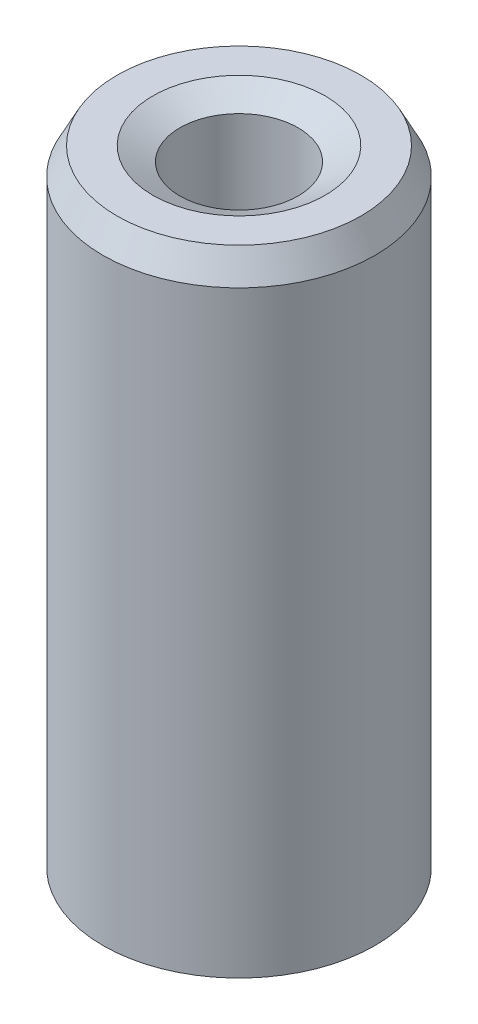
ISO-10303-21;
HEADER;
FILE_DESCRIPTION(('STEP AP214'),'2;1');
FILE_NAME('part.step','',(''),(''),'','','');
FILE_SCHEMA(('AUTOMOTIVE_DESIGN { 1 0 10303 214 1 1 1 1 }'));
ENDSEC;
DATA;
#1=APPLICATION_CONTEXT('core data for automotive mechanical design processes');
#2=APPLICATION_PROTOCOL_DEFINITION('international standard','automotive_design',2000,#1);
#3=PRODUCT_CONTEXT('',#1,'mechanical');
#4=PRODUCT('Part','Part','',(#3));
#5=PRODUCT_RELATED_PRODUCT_CATEGORY('part','',(#4));
#6=PRODUCT_DEFINITION_FORMATION('','',#4);
#7=PRODUCT_DEFINITION_CONTEXT('part definition',#1,'design');
#8=PRODUCT_DEFINITION('design','',#6,#7);
#9=PRODUCT_DEFINITION_SHAPE('','',#8);
#10=(LENGTH_UNIT() NAMED_UNIT(*) SI_UNIT(.MILLI.,.METRE.));
#11=(NAMED_UNIT(*) PLANE_ANGLE_UNIT() SI_UNIT($,.RADIAN.));
#12=(NAMED_UNIT(*) SI_UNIT($,.STERADIAN.) SOLID_ANGLE_UNIT());
#13=UNCERTAINTY_MEASURE_WITH_UNIT(LENGTH_MEASURE(1.E-05),#10,'distance_accuracy_value','');
#14=(GEOMETRIC_REPRESENTATION_CONTEXT(3) GLOBAL_UNCERTAINTY_ASSIGNED_CONTEXT((#13)) GLOBAL_UNIT_ASSIGNED_CONTEXT((#10,
#11,#12)) REPRESENTATION_CONTEXT('',''));
#15=CARTESIAN_POINT('',(0.,0.,0.));
#16=DIRECTION('',(0.,0.,1.));
#17=DIRECTION('',(1.,0.,0.));
#18=AXIS2_PLACEMENT_3D('',#15,#16,#17);
#19=CARTESIAN_POINT('',(0.,70.427813120426,0.));
#20=DIRECTION('',(0.,-1.,0.));
#21=DIRECTION('',(0.,0.,-1.));
#22=AXIS2_PLACEMENT_3D('',#19,#20,#21);
#23=CYLINDRICAL_SURFACE('',#22,15.);
#24=CARTESIAN_POINT('',(0.,1.5531565680334,0.));
#25=DIRECTION('',(0.,1.,0.));
#26=DIRECTION('',(0.,0.,1.));
#27=AXIS2_PLACEMENT_3D('',#24,#25,#26);
#28=CIRCLE('',#27,15.);
#29=CARTESIAN_POINT('',(0.,1.5531565680334,15.));
#30=VERTEX_POINT('',#29);
#31=EDGE_CURVE('E10',#30,#30,#28,.T.);
#32=ORIENTED_EDGE('',*,*,#31,.T.);
#33=EDGE_LOOP('',(#32));
#34=FACE_BOUND('',#33,.T.);
#35=CARTESIAN_POINT('',(0.,67.4477065241411,0.));
#36=DIRECTION('',(0.,1.,0.));
#37=DIRECTION('',(0.,0.,1.));
#38=AXIS2_PLACEMENT_3D('',#35,#36,#37);
#39=CIRCLE('',#38,15.);
#40=CARTESIAN_POINT('',(0.,67.4477065241411,15.));
#41=VERTEX_POINT('',#40);
#42=EDGE_CURVE('E50',#41,#41,#39,.F.);
#43=ORIENTED_EDGE('',*,*,#42,.T.);
#44=EDGE_LOOP('',(#43));
#45=FACE_BOUND('',#44,.T.);
#46=ADVANCED_FACE('F39',(#34,#45),#23,.T.);
#47=CARTESIAN_POINT('',(0.,70.427813120426,0.));
#48=DIRECTION('',(0.,1.,0.));
#49=DIRECTION('',(0.,0.,1.));
#50=AXIS2_PLACEMENT_3D('',#47,#48,#49);
#51=PLANE('',#50);
#52=CARTESIAN_POINT('',(0.,70.427813120426,0.));
#53=DIRECTION('',(0.,1.,0.));
#54=DIRECTION('',(0.,0.,1.));
#55=AXIS2_PLACEMENT_3D('',#52,#53,#54);
#56=CIRCLE('',#55,9.4978877412631);
#57=CARTESIAN_POINT('',(0.,70.427813120426,9.49788774126309));
#58=VERTEX_POINT('',#57);
#59=EDGE_CURVE('E58',#58,#58,#56,.F.);
#60=ORIENTED_EDGE('',*,*,#59,.T.);
#61=EDGE_LOOP('',(#60));
#62=FACE_BOUND('',#61,.T.);
#63=CARTESIAN_POINT('',(0.,70.427813120426,0.));
#64=DIRECTION('',(0.,1.,0.));
#65=DIRECTION('',(0.,0.,1.));
#66=AXIS2_PLACEMENT_3D('',#63,#64,#65);
#67=CIRCLE('',#66,13.4468434319666);
#68=CARTESIAN_POINT('',(0.,70.427813120426,13.4468434319666));
#69=VERTEX_POINT('',#68);
#70=EDGE_CURVE('E61',#69,#69,#67,.T.);
#71=ORIENTED_EDGE('',*,*,#70,.T.);
#72=EDGE_LOOP('',(#71));
#73=FACE_BOUND('',#72,.T.);
#74=ADVANCED_FACE('F88',(#62,#73),#51,.T.);
#75=CARTESIAN_POINT('',(0.,0.,0.));
#76=DIRECTION('',(0.,1.,0.));
#77=DIRECTION('',(0.,0.,1.));
#78=AXIS2_PLACEMENT_3D('',#75,#76,#77);
#79=PLANE('',#78);
#80=CARTESIAN_POINT('',(0.,0.,0.));
#81=DIRECTION('',(0.,1.,0.));
#82=DIRECTION('',(0.,0.,1.));
#83=AXIS2_PLACEMENT_3D('',#80,#81,#82);
#84=CIRCLE('',#83,8.07093771301164);
#85=CARTESIAN_POINT('',(0.,0.,8.07093771301164));
#86=VERTEX_POINT('',#85);
#87=EDGE_CURVE('E51',#86,#86,#84,.T.);
#88=ORIENTED_EDGE('',*,*,#87,.T.);
#89=EDGE_LOOP('',(#88));
#90=FACE_BOUND('',#89,.T.);
#91=CARTESIAN_POINT('',(0.,0.,0.));
#92=DIRECTION('',(0.,1.,0.));
#93=DIRECTION('',(0.,0.,1.));
#94=AXIS2_PLACEMENT_3D('',#91,#92,#93);
#95=CIRCLE('',#94,12.0198934037151);
#96=CARTESIAN_POINT('',(0.,0.,12.0198934037151));
#97=VERTEX_POINT('',#96);
#98=EDGE_CURVE('E54',#97,#97,#95,.F.);
#99=ORIENTED_EDGE('',*,*,#98,.T.);
#100=EDGE_LOOP('',(#99));
#101=FACE_BOUND('',#100,.T.);
#102=ADVANCED_FACE('F83',(#90,#101),#79,.F.);
#103=CARTESIAN_POINT('',(0.,70.427813120426,0.));
#104=DIRECTION('',(0.,-1.,0.));
#105=DIRECTION('',(0.,0.,-1.));
#106=AXIS2_PLACEMENT_3D('',#103,#104,#105);
#107=CYLINDRICAL_SURFACE('',#106,6.51778114497823);
#108=CARTESIAN_POINT('',(0.,68.8746565523926,0.));
#109=DIRECTION('',(0.,1.,0.));
#110=DIRECTION('',(0.,0.,1.));
#111=AXIS2_PLACEMENT_3D('',#108,#109,#110);
#112=CIRCLE('',#111,6.51778114497823);
#113=CARTESIAN_POINT('',(0.,68.8746565523926,6.51778114497821));
#114=VERTEX_POINT('',#113);
#115=EDGE_CURVE('E67',#114,#114,#112,.T.);
#116=ORIENTED_EDGE('',*,*,#115,.T.);
#117=EDGE_LOOP('',(#116));
#118=FACE_BOUND('',#117,.T.);
#119=CARTESIAN_POINT('',(0.,2.98010659628489,0.));
#120=DIRECTION('',(0.,1.,0.));
#121=DIRECTION('',(0.,0.,1.));
#122=AXIS2_PLACEMENT_3D('',#119,#120,#121);
#123=CIRCLE('',#122,6.51778114497823);
#124=CARTESIAN_POINT('',(0.,2.98010659628489,6.51778114497823));
#125=VERTEX_POINT('',#124);
#126=EDGE_CURVE('E69',#125,#125,#123,.F.);
#127=ORIENTED_EDGE('',*,*,#126,.T.);
#128=EDGE_LOOP('',(#127));
#129=FACE_BOUND('',#128,.T.);
#130=ADVANCED_FACE('F71',(#118,#129),#107,.F.);
#131=CARTESIAN_POINT('',(0.,68.8746565523926,0.));
#132=DIRECTION('',(0.,1.,0.));
#133=DIRECTION('',(0.,0.,1.));
#134=AXIS2_PLACEMENT_3D('',#131,#132,#133);
#135=CONICAL_SURFACE('',#134,6.51778114497823,1.09035270273021);
#136=CARTESIAN_POINT('',(0.,70.427813120426,9.49788774126309));
#137=CARTESIAN_POINT('',(0.,70.4116344061757,9.46684496421845));
#138=CARTESIAN_POINT('',(0.,70.3954556919253,9.43580218717382));
#139=CARTESIAN_POINT('',(0.,70.3630982634246,9.37371663308455));
#140=CARTESIAN_POINT('',(0.,70.3469195491743,9.34267385603992));
#141=CARTESIAN_POINT('',(0.,70.3145621206736,9.28058830195065));
#142=CARTESIAN_POINT('',(0.,70.2983834064233,9.24954552490602));
#143=CARTESIAN_POINT('',(0.,70.2660259779226,9.18745997081675));
#144=CARTESIAN_POINT('',(0.,70.2498472636722,9.15641719377211));
#145=CARTESIAN_POINT('',(0.,70.2174898351715,9.09433163968285));
#146=CARTESIAN_POINT('',(0.,70.2013111209211,9.06328886263821));
#147=CARTESIAN_POINT('',(0.,70.1689536924205,9.00120330854894));
#148=CARTESIAN_POINT('',(0.,70.1527749781701,8.97016053150431));
#149=CARTESIAN_POINT('',(0.,70.1204175496694,8.90807497741504));
#150=CARTESIAN_POINT('',(0.,70.1042388354191,8.87703220037041));
#151=CARTESIAN_POINT('',(0.,70.0718814069184,8.81494664628114));
#152=CARTESIAN_POINT('',(0.,70.055702692668,8.78390386923651));
#153=CARTESIAN_POINT('',(0.,70.0233452641673,8.72181831514724));
#154=CARTESIAN_POINT('',(0.,70.007166549917,8.6907755381026));
#155=CARTESIAN_POINT('',(0.,69.9748091214163,8.62868998401333));
#156=CARTESIAN_POINT('',(0.,69.9586304071659,8.5976472069687));
#157=CARTESIAN_POINT('',(0.,69.9262729786652,8.53556165287943));
#158=CARTESIAN_POINT('',(0.,69.9100942644149,8.5045188758348));
#159=CARTESIAN_POINT('',(0.,69.8777368359142,8.44243332174553));
#160=CARTESIAN_POINT('',(0.,69.8615581216638,8.41139054470089));
#161=CARTESIAN_POINT('',(0.,69.8292006931632,8.34930499061163));
#162=CARTESIAN_POINT('',(0.,69.8130219789128,8.31826221356699));
#163=CARTESIAN_POINT('',(0.,69.7806645504121,8.25617665947772));
#164=CARTESIAN_POINT('',(0.,69.7644858361618,8.22513388243309));
#165=CARTESIAN_POINT('',(0.,69.7321284076611,8.16304832834382));
#166=CARTESIAN_POINT('',(0.,69.7159496934107,8.13200555129919));
#167=CARTESIAN_POINT('',(0.,69.68359226491,8.06991999720992));
#168=CARTESIAN_POINT('',(0.,69.6674135506597,8.03887722016528));
#169=CARTESIAN_POINT('',(0.,69.635056122159,7.97679166607602));
#170=CARTESIAN_POINT('',(0.,69.6188774079086,7.94574888903139));
#171=CARTESIAN_POINT('',(0.,69.5865199794079,7.88366333494212));
#172=CARTESIAN_POINT('',(0.,69.5703412651576,7.85262055789748));
#173=CARTESIAN_POINT('',(0.,69.5379838366569,7.79053500380821));
#174=CARTESIAN_POINT('',(0.,69.5218051224065,7.75949222676358));
#175=CARTESIAN_POINT('',(0.,69.4894476939058,7.69740667267431));
#176=CARTESIAN_POINT('',(0.,69.4732689796555,7.66636389562968));
#177=CARTESIAN_POINT('',(0.,69.4409115511548,7.60427834154041));
#178=CARTESIAN_POINT('',(0.,69.4247328369045,7.57323556449577));
#179=CARTESIAN_POINT('',(0.,69.3923754084038,7.5111500104065));
#180=CARTESIAN_POINT('',(0.,69.3761966941534,7.48010723336187));
#181=CARTESIAN_POINT('',(0.,69.3438392656527,7.4180216792726));
#182=CARTESIAN_POINT('',(0.,69.3276605514024,7.38697890222797));
#183=CARTESIAN_POINT('',(0.,69.2953031229017,7.3248933481387));
#184=CARTESIAN_POINT('',(0.,69.2791244086513,7.29385057109407));
#185=CARTESIAN_POINT('',(0.,69.2467669801506,7.2317650170048));
#186=CARTESIAN_POINT('',(0.,69.2305882659003,7.20072223996016));
#187=CARTESIAN_POINT('',(0.,69.1982308373996,7.1386366858709));
#188=CARTESIAN_POINT('',(0.,69.1820521231492,7.10759390882626));
#189=CARTESIAN_POINT('',(0.,69.1496946946485,7.04550835473699));
#190=CARTESIAN_POINT('',(0.,69.1335159803982,7.01446557769236));
#191=CARTESIAN_POINT('',(0.,69.1011585518975,6.95238002360309));
#192=CARTESIAN_POINT('',(0.,69.0849798376471,6.92133724655846));
#193=CARTESIAN_POINT('',(0.,69.0526224091465,6.85925169246919));
#194=CARTESIAN_POINT('',(0.,69.0364436948961,6.82820891542456));
#195=CARTESIAN_POINT('',(0.,69.0040862663954,6.76612336133529));
#196=CARTESIAN_POINT('',(0.,68.987907552145,6.73508058429065));
#197=CARTESIAN_POINT('',(0.,68.9555501236444,6.67299503020138));
#198=CARTESIAN_POINT('',(0.,68.939371409394,6.64195225315675));
#199=CARTESIAN_POINT('',(0.,68.9070139808933,6.57986669906748));
#200=CARTESIAN_POINT('',(0.,68.890835266643,6.54882392202285));
#201=CARTESIAN_POINT('',(0.,68.8746565523926,6.51778114497821));
#202=B_SPLINE_CURVE_WITH_KNOTS('',3,(#136,#137,#138,#139,#140,#141,#142,#143,#144,#145,#146,
#147,#148,#149,#150,#151,#152,#153,#154,#155,#156,#157,#158,#159,#160,#161,#162,#163,#164,#165,
#166,#167,#168,#169,#170,#171,#172,#173,#174,#175,#176,#177,#178,#179,#180,#181,#182,#183,#184,
#185,#186,#187,#188,#189,#190,#191,#192,#193,#194,#195,#196,#197,#198,#199,#200,#201),
.UNSPECIFIED.,.F.,.F.,(4,2,2,2,2,2,2,2,2,2,2,2,2,2,2,2,2,2,2,2,2,2,2,2,2,2,2,2,2,2,2,2,4),(0.,
0.105017347200043,0.210034694400094,0.315052041600139,0.420069388800188,0.525086736000239,
0.630104083200284,0.735121430400335,0.840138777600384,0.945156124800429,1.05017347200048,
1.15519081920053,1.26020816640057,1.36522551360063,1.47024286080067,1.57526020800072,
1.68027755520077,1.78529490240082,1.89031224960086,1.99532959680092,2.10034694400097,
2.20536429120101,2.31038163840106,2.41539898560111,2.52041633280115,2.6254336800012,
2.73045102720126,2.8354683744013,2.94048572160135,3.0455030688014,3.15052041600145,
3.2555377632015,3.36055511040154),.UNSPECIFIED.);
#203=EDGE_CURVE('BSEAM77',#58,#114,#202,.T.);
#204=ORIENTED_EDGE('',*,*,#59,.F.);
#205=ORIENTED_EDGE('',*,*,#115,.F.);
#206=ORIENTED_EDGE('',*,*,#203,.T.);
#207=ORIENTED_EDGE('',*,*,#203,.F.);
#208=EDGE_LOOP('',(#204,#206,#205,#207));
#209=FACE_BOUND('',#208,.T.);
#210=ADVANCED_FACE('F77',(#209),#135,.F.);
#211=CARTESIAN_POINT('',(0.,0.,0.));
#212=DIRECTION('',(0.,-1.,0.));
#213=DIRECTION('',(0.,0.,-1.));
#214=AXIS2_PLACEMENT_3D('',#211,#212,#213);
#215=CONICAL_SURFACE('',#214,8.07093771301164,0.480443624064682);
#216=ORIENTED_EDGE('',*,*,#126,.F.);
#217=EDGE_LOOP('',(#216));
#218=FACE_BOUND('',#217,.T.);
#219=ORIENTED_EDGE('',*,*,#87,.F.);
#220=EDGE_LOOP('',(#219));
#221=FACE_BOUND('',#220,.T.);
#222=ADVANCED_FACE('F73',(#218,#221),#215,.F.);
#223=CARTESIAN_POINT('',(0.,1.5531565680334,0.));
#224=DIRECTION('',(0.,1.,0.));
#225=DIRECTION('',(0.,0.,1.));
#226=AXIS2_PLACEMENT_3D('',#223,#224,#225);
#227=CONICAL_SURFACE('',#226,15.,1.09035270273022);
#228=ORIENTED_EDGE('',*,*,#98,.F.);
#229=EDGE_LOOP('',(#228));
#230=FACE_BOUND('',#229,.T.);
#231=ORIENTED_EDGE('',*,*,#31,.F.);
#232=EDGE_LOOP('',(#231));
#233=FACE_BOUND('',#232,.T.);
#234=ADVANCED_FACE('F76',(#230,#233),#227,.T.);
#235=CARTESIAN_POINT('',(0.,70.427813120426,0.));
#236=DIRECTION('',(0.,-1.,0.));
#237=DIRECTION('',(0.,0.,-1.));
#238=AXIS2_PLACEMENT_3D('',#235,#236,#237);
#239=CONICAL_SURFACE('',#238,13.4468434319666,0.48044362406468);
#240=ORIENTED_EDGE('',*,*,#42,.F.);
#241=EDGE_LOOP('',(#240));
#242=FACE_BOUND('',#241,.T.);
#243=ORIENTED_EDGE('',*,*,#70,.F.);
#244=EDGE_LOOP('',(#243));
#245=FACE_BOUND('',#244,.T.);
#246=ADVANCED_FACE('F45',(#242,#245),#239,.T.);
#247=CLOSED_SHELL('',(#46,#74,#102,#130,#210,#222,#234,#246));
#248=MANIFOLD_SOLID_BREP('B2',#247);
#249=ADVANCED_BREP_SHAPE_REPRESENTATION('',(#18,#248),#14);
#250=SHAPE_DEFINITION_REPRESENTATION(#9,#249);
ENDSEC;
END-ISO-10303-21;
